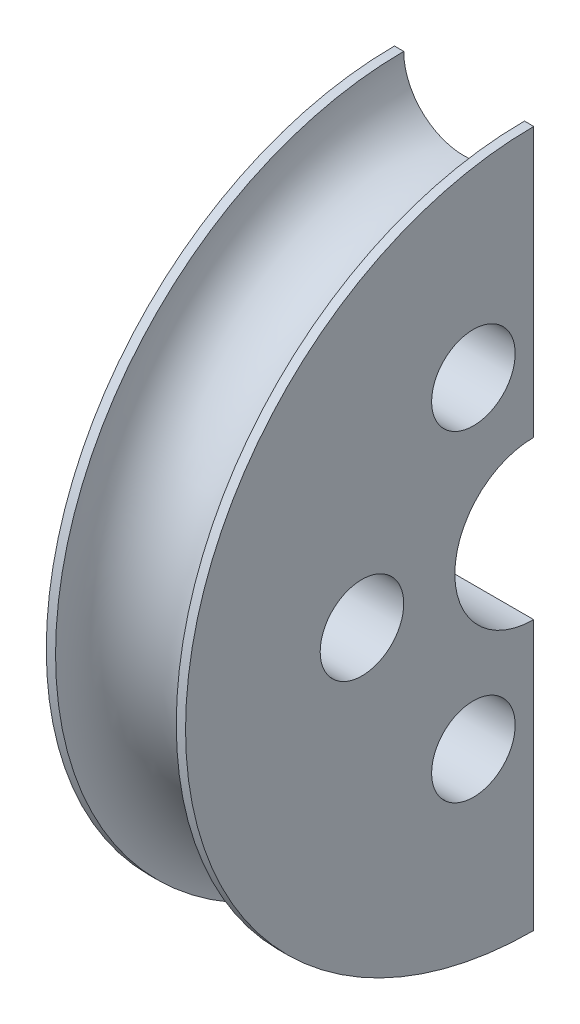
ISO-10303-21;
HEADER;
FILE_DESCRIPTION(('STEP AP214'),'2;1');
FILE_NAME('part.step','',(''),(''),'','','');
FILE_SCHEMA(('AUTOMOTIVE_DESIGN { 1 0 10303 214 1 1 1 1 }'));
ENDSEC;
DATA;
#1=APPLICATION_CONTEXT('core data for automotive mechanical design processes');
#2=APPLICATION_PROTOCOL_DEFINITION('international standard','automotive_design',2000,#1);
#3=PRODUCT_CONTEXT('',#1,'mechanical');
#4=PRODUCT('Part','Part','',(#3));
#5=PRODUCT_RELATED_PRODUCT_CATEGORY('part','',(#4));
#6=PRODUCT_DEFINITION_FORMATION('','',#4);
#7=PRODUCT_DEFINITION_CONTEXT('part definition',#1,'design');
#8=PRODUCT_DEFINITION('design','',#6,#7);
#9=PRODUCT_DEFINITION_SHAPE('','',#8);
#10=(LENGTH_UNIT() NAMED_UNIT(*) SI_UNIT(.MILLI.,.METRE.));
#11=(NAMED_UNIT(*) PLANE_ANGLE_UNIT() SI_UNIT($,.RADIAN.));
#12=(NAMED_UNIT(*) SI_UNIT($,.STERADIAN.) SOLID_ANGLE_UNIT());
#13=UNCERTAINTY_MEASURE_WITH_UNIT(LENGTH_MEASURE(1.E-05),#10,'distance_accuracy_value','');
#14=(GEOMETRIC_REPRESENTATION_CONTEXT(3) GLOBAL_UNCERTAINTY_ASSIGNED_CONTEXT((#13)) GLOBAL_UNIT_ASSIGNED_CONTEXT((#10,
#11,#12)) REPRESENTATION_CONTEXT('',''));
#15=CARTESIAN_POINT('',(0.,0.,0.));
#16=DIRECTION('',(0.,0.,1.));
#17=DIRECTION('',(1.,0.,0.));
#18=AXIS2_PLACEMENT_3D('',#15,#16,#17);
#19=CARTESIAN_POINT('',(0.,0.,0.));
#20=DIRECTION('',(-1.,0.,0.));
#21=DIRECTION('',(0.,0.,1.));
#22=AXIS2_PLACEMENT_3D('',#19,#20,#21);
#23=CYLINDRICAL_SURFACE('',#22,75.);
#24=CARTESIAN_POINT('',(0.,0.,0.));
#25=DIRECTION('',(-1.,0.,0.));
#26=DIRECTION('',(0.,0.,1.));
#27=AXIS2_PLACEMENT_3D('',#24,#25,#26);
#28=CIRCLE('',#27,75.);
#29=CARTESIAN_POINT('',(0.,-75.,-5.2372220082647E-13));
#30=VERTEX_POINT('',#29);
#31=CARTESIAN_POINT('',(0.,75.,0.));
#32=VERTEX_POINT('',#31);
#33=EDGE_CURVE('E13',#30,#32,#28,.T.);
#34=ORIENTED_EDGE('',*,*,#33,.F.);
#35=DIRECTION('',(-1.,0.,0.));
#36=VECTOR('',#35,1.);
#37=CARTESIAN_POINT('',(0.,-75.,-5.2372220082647E-13));
#38=LINE('',#37,#36);
#39=CARTESIAN_POINT('',(2.,-75.,-5.2372220082647E-13));
#40=VERTEX_POINT('',#39);
#41=EDGE_CURVE('E129',#40,#30,#38,.T.);
#42=ORIENTED_EDGE('',*,*,#41,.F.);
#43=CARTESIAN_POINT('',(2.,0.,0.));
#44=DIRECTION('',(-1.,0.,0.));
#45=DIRECTION('',(0.,0.,1.));
#46=AXIS2_PLACEMENT_3D('',#43,#44,#45);
#47=CIRCLE('',#46,75.);
#48=CARTESIAN_POINT('',(2.,75.,0.));
#49=VERTEX_POINT('',#48);
#50=EDGE_CURVE('E61',#40,#49,#47,.T.);
#51=ORIENTED_EDGE('',*,*,#50,.T.);
#52=DIRECTION('',(-1.,0.,0.));
#53=VECTOR('',#52,1.);
#54=CARTESIAN_POINT('',(0.,75.,0.));
#55=LINE('',#54,#53);
#56=EDGE_CURVE('E109',#49,#32,#55,.T.);
#57=ORIENTED_EDGE('',*,*,#56,.T.);
#58=EDGE_LOOP('',(#34,#42,#51,#57));
#59=FACE_BOUND('',#58,.T.);
#60=ADVANCED_FACE('F46',(#59),#23,.T.);
#61=CARTESIAN_POINT('',(0.,-17.,-1.18710365520667E-13));
#62=DIRECTION('',(1.,0.,0.));
#63=DIRECTION('',(0.,0.,-1.));
#64=AXIS2_PLACEMENT_3D('',#61,#62,#63);
#65=PLANE('',#64);
#66=CARTESIAN_POINT('',(0.,-34.6410161513777,12.9999999999995));
#67=DIRECTION('',(-1.,0.,0.));
#68=DIRECTION('',(0.,0.,1.));
#69=AXIS2_PLACEMENT_3D('',#66,#67,#68);
#70=CIRCLE('',#69,9.00000000000001);
#71=CARTESIAN_POINT('',(0.,-34.6410161513777,21.9999999999995));
#72=VERTEX_POINT('',#71);
#73=EDGE_CURVE('E206',#72,#72,#70,.T.);
#74=ORIENTED_EDGE('',*,*,#73,.F.);
#75=EDGE_LOOP('',(#74));
#76=FACE_BOUND('',#75,.T.);
#77=CARTESIAN_POINT('',(0.,34.6410161513775,13.));
#78=DIRECTION('',(-1.,0.,0.));
#79=DIRECTION('',(0.,0.,1.));
#80=AXIS2_PLACEMENT_3D('',#77,#78,#79);
#81=CIRCLE('',#80,9.);
#82=CARTESIAN_POINT('',(0.,34.6410161513775,22.));
#83=VERTEX_POINT('',#82);
#84=EDGE_CURVE('E212',#83,#83,#81,.T.);
#85=ORIENTED_EDGE('',*,*,#84,.F.);
#86=EDGE_LOOP('',(#85));
#87=FACE_BOUND('',#86,.T.);
#88=CARTESIAN_POINT('',(0.,0.,37.));
#89=DIRECTION('',(-1.,0.,0.));
#90=DIRECTION('',(0.,0.,1.));
#91=AXIS2_PLACEMENT_3D('',#88,#89,#90);
#92=CIRCLE('',#91,9.);
#93=CARTESIAN_POINT('',(0.,0.,46.));
#94=VERTEX_POINT('',#93);
#95=EDGE_CURVE('E209',#94,#94,#92,.T.);
#96=ORIENTED_EDGE('',*,*,#95,.F.);
#97=EDGE_LOOP('',(#96));
#98=FACE_BOUND('',#97,.T.);
#99=CARTESIAN_POINT('',(0.,0.,0.));
#100=DIRECTION('',(-1.,0.,0.));
#101=DIRECTION('',(0.,0.,1.));
#102=AXIS2_PLACEMENT_3D('',#99,#100,#101);
#103=CIRCLE('',#102,17.);
#104=CARTESIAN_POINT('',(0.,-17.,-1.18710365520667E-13));
#105=VERTEX_POINT('',#104);
#106=CARTESIAN_POINT('',(0.,17.,0.));
#107=VERTEX_POINT('',#106);
#108=EDGE_CURVE('E54',#105,#107,#103,.T.);
#109=ORIENTED_EDGE('',*,*,#108,.F.);
#110=DIRECTION('',(0.,1.,0.));
#111=VECTOR('',#110,1.);
#112=CARTESIAN_POINT('',(0.,-17.,-1.18710365520667E-13));
#113=LINE('',#112,#111);
#114=EDGE_CURVE('E105',#30,#105,#113,.T.);
#115=ORIENTED_EDGE('',*,*,#114,.F.);
#116=ORIENTED_EDGE('',*,*,#33,.T.);
#117=DIRECTION('',(0.,-1.,0.));
#118=VECTOR('',#117,1.);
#119=CARTESIAN_POINT('',(0.,17.,0.));
#120=LINE('',#119,#118);
#121=EDGE_CURVE('E102',#32,#107,#120,.T.);
#122=ORIENTED_EDGE('',*,*,#121,.T.);
#123=EDGE_LOOP('',(#109,#115,#116,#122));
#124=FACE_BOUND('',#123,.T.);
#125=ADVANCED_FACE('F48',(#76,#87,#98,#124),#65,.F.);
#126=CARTESIAN_POINT('',(0.,0.,0.));
#127=DIRECTION('',(-1.,0.,0.));
#128=DIRECTION('',(0.,0.,1.));
#129=AXIS2_PLACEMENT_3D('',#126,#127,#128);
#130=CYLINDRICAL_SURFACE('',#129,17.);
#131=CARTESIAN_POINT('',(30.,0.,0.));
#132=DIRECTION('',(-1.,0.,0.));
#133=DIRECTION('',(0.,0.,1.));
#134=AXIS2_PLACEMENT_3D('',#131,#132,#133);
#135=CIRCLE('',#134,17.);
#136=CARTESIAN_POINT('',(30.,-17.,-1.18710365520667E-13));
#137=VERTEX_POINT('',#136);
#138=CARTESIAN_POINT('',(30.,17.,0.));
#139=VERTEX_POINT('',#138);
#140=EDGE_CURVE('E147',#137,#139,#135,.T.);
#141=ORIENTED_EDGE('',*,*,#140,.F.);
#142=DIRECTION('',(1.,0.,0.));
#143=VECTOR('',#142,1.);
#144=CARTESIAN_POINT('',(0.,-17.,-1.18710365520667E-13));
#145=LINE('',#144,#143);
#146=EDGE_CURVE('E132',#105,#137,#145,.T.);
#147=ORIENTED_EDGE('',*,*,#146,.F.);
#148=ORIENTED_EDGE('',*,*,#108,.T.);
#149=DIRECTION('',(1.,0.,0.));
#150=VECTOR('',#149,1.);
#151=CARTESIAN_POINT('',(0.,17.,0.));
#152=LINE('',#151,#150);
#153=EDGE_CURVE('E117',#107,#139,#152,.T.);
#154=ORIENTED_EDGE('',*,*,#153,.T.);
#155=EDGE_LOOP('',(#141,#147,#148,#154));
#156=FACE_BOUND('',#155,.T.);
#157=ADVANCED_FACE('F150',(#156),#130,.F.);
#158=CARTESIAN_POINT('',(30.,-75.,-5.2372220082647E-13));
#159=DIRECTION('',(-1.,0.,0.));
#160=DIRECTION('',(0.,0.,1.));
#161=AXIS2_PLACEMENT_3D('',#158,#159,#160);
#162=PLANE('',#161);
#163=CARTESIAN_POINT('',(30.,-34.6410161513777,12.9999999999995));
#164=DIRECTION('',(-1.,0.,0.));
#165=DIRECTION('',(0.,0.,1.));
#166=AXIS2_PLACEMENT_3D('',#163,#164,#165);
#167=CIRCLE('',#166,9.00000000000001);
#168=CARTESIAN_POINT('',(30.,-34.6410161513777,21.9999999999995));
#169=VERTEX_POINT('',#168);
#170=EDGE_CURVE('E203',#169,#169,#167,.T.);
#171=ORIENTED_EDGE('',*,*,#170,.T.);
#172=EDGE_LOOP('',(#171));
#173=FACE_BOUND('',#172,.T.);
#174=CARTESIAN_POINT('',(30.,34.6410161513775,13.));
#175=DIRECTION('',(-1.,0.,0.));
#176=DIRECTION('',(0.,0.,1.));
#177=AXIS2_PLACEMENT_3D('',#174,#175,#176);
#178=CIRCLE('',#177,9.);
#179=CARTESIAN_POINT('',(30.,34.6410161513775,22.));
#180=VERTEX_POINT('',#179);
#181=EDGE_CURVE('E207',#180,#180,#178,.T.);
#182=ORIENTED_EDGE('',*,*,#181,.T.);
#183=EDGE_LOOP('',(#182));
#184=FACE_BOUND('',#183,.T.);
#185=CARTESIAN_POINT('',(30.,0.,37.));
#186=DIRECTION('',(-1.,0.,0.));
#187=DIRECTION('',(0.,0.,1.));
#188=AXIS2_PLACEMENT_3D('',#185,#186,#187);
#189=CIRCLE('',#188,9.);
#190=CARTESIAN_POINT('',(30.,0.,46.));
#191=VERTEX_POINT('',#190);
#192=EDGE_CURVE('E112',#191,#191,#189,.T.);
#193=ORIENTED_EDGE('',*,*,#192,.T.);
#194=EDGE_LOOP('',(#193));
#195=FACE_BOUND('',#194,.T.);
#196=CARTESIAN_POINT('',(30.,0.,0.));
#197=DIRECTION('',(-1.,0.,0.));
#198=DIRECTION('',(0.,0.,1.));
#199=AXIS2_PLACEMENT_3D('',#196,#197,#198);
#200=CIRCLE('',#199,75.);
#201=CARTESIAN_POINT('',(30.,-75.,-5.2372220082647E-13));
#202=VERTEX_POINT('',#201);
#203=CARTESIAN_POINT('',(30.,75.,0.));
#204=VERTEX_POINT('',#203);
#205=EDGE_CURVE('E145',#202,#204,#200,.T.);
#206=ORIENTED_EDGE('',*,*,#205,.F.);
#207=DIRECTION('',(0.,-1.,0.));
#208=VECTOR('',#207,1.);
#209=CARTESIAN_POINT('',(30.,-75.,-5.2372220082647E-13));
#210=LINE('',#209,#208);
#211=EDGE_CURVE('E135',#137,#202,#210,.T.);
#212=ORIENTED_EDGE('',*,*,#211,.F.);
#213=ORIENTED_EDGE('',*,*,#140,.T.);
#214=DIRECTION('',(0.,1.,0.));
#215=VECTOR('',#214,1.);
#216=CARTESIAN_POINT('',(30.,75.,0.));
#217=LINE('',#216,#215);
#218=EDGE_CURVE('E119',#139,#204,#217,.T.);
#219=ORIENTED_EDGE('',*,*,#218,.T.);
#220=EDGE_LOOP('',(#206,#212,#213,#219));
#221=FACE_BOUND('',#220,.T.);
#222=ADVANCED_FACE('F158',(#173,#184,#195,#221),#162,.F.);
#223=CARTESIAN_POINT('',(0.,0.,0.));
#224=DIRECTION('',(-1.,0.,0.));
#225=DIRECTION('',(0.,0.,1.));
#226=AXIS2_PLACEMENT_3D('',#223,#224,#225);
#227=CYLINDRICAL_SURFACE('',#226,75.);
#228=CARTESIAN_POINT('',(28.,0.,0.));
#229=DIRECTION('',(-1.,0.,0.));
#230=DIRECTION('',(0.,0.,1.));
#231=AXIS2_PLACEMENT_3D('',#228,#229,#230);
#232=CIRCLE('',#231,75.);
#233=CARTESIAN_POINT('',(28.,-75.,-5.2372220082647E-13));
#234=VERTEX_POINT('',#233);
#235=CARTESIAN_POINT('',(28.,75.,0.));
#236=VERTEX_POINT('',#235);
#237=EDGE_CURVE('E69',#234,#236,#232,.T.);
#238=ORIENTED_EDGE('',*,*,#237,.F.);
#239=DIRECTION('',(-1.,0.,0.));
#240=VECTOR('',#239,1.);
#241=CARTESIAN_POINT('',(28.,-75.,-5.2372220082647E-13));
#242=LINE('',#241,#240);
#243=EDGE_CURVE('E138',#202,#234,#242,.T.);
#244=ORIENTED_EDGE('',*,*,#243,.F.);
#245=ORIENTED_EDGE('',*,*,#205,.T.);
#246=DIRECTION('',(-1.,0.,0.));
#247=VECTOR('',#246,1.);
#248=CARTESIAN_POINT('',(28.,75.,0.));
#249=LINE('',#248,#247);
#250=EDGE_CURVE('E125',#204,#236,#249,.T.);
#251=ORIENTED_EDGE('',*,*,#250,.T.);
#252=EDGE_LOOP('',(#238,#244,#245,#251));
#253=FACE_BOUND('',#252,.T.);
#254=ADVANCED_FACE('F156',(#253),#227,.T.);
#255=CARTESIAN_POINT('',(15.,0.,0.));
#256=DIRECTION('',(-1.,0.,0.));
#257=DIRECTION('',(0.,0.,1.));
#258=AXIS2_PLACEMENT_3D('',#255,#256,#257);
#259=TOROIDAL_SURFACE('',#258,75.,13.);
#260=CARTESIAN_POINT('',(15.,-75.,-5.2372220082647E-13));
#261=DIRECTION('',(0.,0.,1.));
#262=DIRECTION('',(1.,0.,0.));
#263=AXIS2_PLACEMENT_3D('',#260,#261,#262);
#264=CIRCLE('',#263,13.);
#265=EDGE_CURVE('E140',#234,#40,#264,.T.);
#266=ORIENTED_EDGE('',*,*,#265,.F.);
#267=ORIENTED_EDGE('',*,*,#237,.T.);
#268=CARTESIAN_POINT('',(15.,75.,0.));
#269=DIRECTION('',(0.,0.,-1.));
#270=DIRECTION('',(1.,0.,0.));
#271=AXIS2_PLACEMENT_3D('',#268,#269,#270);
#272=CIRCLE('',#271,13.);
#273=EDGE_CURVE('E127',#236,#49,#272,.T.);
#274=ORIENTED_EDGE('',*,*,#273,.T.);
#275=ORIENTED_EDGE('',*,*,#50,.F.);
#276=EDGE_LOOP('',(#266,#267,#274,#275));
#277=FACE_BOUND('',#276,.T.);
#278=ADVANCED_FACE('F154',(#277),#259,.F.);
#279=CARTESIAN_POINT('',(15.,-75.,-5.2372220082647E-13));
#280=DIRECTION('',(0.,0.,-1.));
#281=DIRECTION('',(1.,0.,0.));
#282=AXIS2_PLACEMENT_3D('',#279,#280,#281);
#283=PLANE('',#282);
#284=ORIENTED_EDGE('',*,*,#41,.T.);
#285=ORIENTED_EDGE('',*,*,#114,.T.);
#286=ORIENTED_EDGE('',*,*,#146,.T.);
#287=ORIENTED_EDGE('',*,*,#211,.T.);
#288=ORIENTED_EDGE('',*,*,#243,.T.);
#289=ORIENTED_EDGE('',*,*,#265,.T.);
#290=EDGE_LOOP('',(#284,#285,#286,#287,#288,#289));
#291=FACE_BOUND('',#290,.T.);
#292=ADVANCED_FACE('F152',(#291),#283,.T.);
#293=CARTESIAN_POINT('',(15.,75.,0.));
#294=DIRECTION('',(0.,0.,1.));
#295=DIRECTION('',(1.,0.,0.));
#296=AXIS2_PLACEMENT_3D('',#293,#294,#295);
#297=PLANE('',#296);
#298=ORIENTED_EDGE('',*,*,#56,.F.);
#299=ORIENTED_EDGE('',*,*,#273,.F.);
#300=ORIENTED_EDGE('',*,*,#250,.F.);
#301=ORIENTED_EDGE('',*,*,#218,.F.);
#302=ORIENTED_EDGE('',*,*,#153,.F.);
#303=ORIENTED_EDGE('',*,*,#121,.F.);
#304=EDGE_LOOP('',(#298,#299,#300,#301,#302,#303));
#305=FACE_BOUND('',#304,.T.);
#306=ADVANCED_FACE('F114',(#305),#297,.F.);
#307=CARTESIAN_POINT('',(30.,0.,37.));
#308=DIRECTION('',(-1.,0.,0.));
#309=DIRECTION('',(0.,0.,1.));
#310=AXIS2_PLACEMENT_3D('',#307,#308,#309);
#311=CYLINDRICAL_SURFACE('',#310,9.);
#312=ORIENTED_EDGE('',*,*,#192,.F.);
#313=EDGE_LOOP('',(#312));
#314=FACE_BOUND('',#313,.T.);
#315=ORIENTED_EDGE('',*,*,#95,.T.);
#316=EDGE_LOOP('',(#315));
#317=FACE_BOUND('',#316,.T.);
#318=ADVANCED_FACE('F185',(#314,#317),#311,.F.);
#319=CARTESIAN_POINT('',(30.,34.6410161513775,13.));
#320=DIRECTION('',(-1.,0.,0.));
#321=DIRECTION('',(0.,0.,1.));
#322=AXIS2_PLACEMENT_3D('',#319,#320,#321);
#323=CYLINDRICAL_SURFACE('',#322,9.);
#324=ORIENTED_EDGE('',*,*,#181,.F.);
#325=EDGE_LOOP('',(#324));
#326=FACE_BOUND('',#325,.T.);
#327=ORIENTED_EDGE('',*,*,#84,.T.);
#328=EDGE_LOOP('',(#327));
#329=FACE_BOUND('',#328,.T.);
#330=ADVANCED_FACE('F189',(#326,#329),#323,.F.);
#331=CARTESIAN_POINT('',(30.,-34.6410161513777,12.9999999999995));
#332=DIRECTION('',(-1.,0.,0.));
#333=DIRECTION('',(0.,0.,1.));
#334=AXIS2_PLACEMENT_3D('',#331,#332,#333);
#335=CYLINDRICAL_SURFACE('',#334,9.00000000000001);
#336=ORIENTED_EDGE('',*,*,#170,.F.);
#337=EDGE_LOOP('',(#336));
#338=FACE_BOUND('',#337,.T.);
#339=ORIENTED_EDGE('',*,*,#73,.T.);
#340=EDGE_LOOP('',(#339));
#341=FACE_BOUND('',#340,.T.);
#342=ADVANCED_FACE('F195',(#338,#341),#335,.F.);
#343=CLOSED_SHELL('',(#60,#125,#157,#222,#254,#278,#292,#306,#318,#330,#342));
#344=MANIFOLD_SOLID_BREP('B2',#343);
#345=ADVANCED_BREP_SHAPE_REPRESENTATION('',(#18,#344),#14);
#346=SHAPE_DEFINITION_REPRESENTATION(#9,#345);
ENDSEC;
END-ISO-10303-21;
